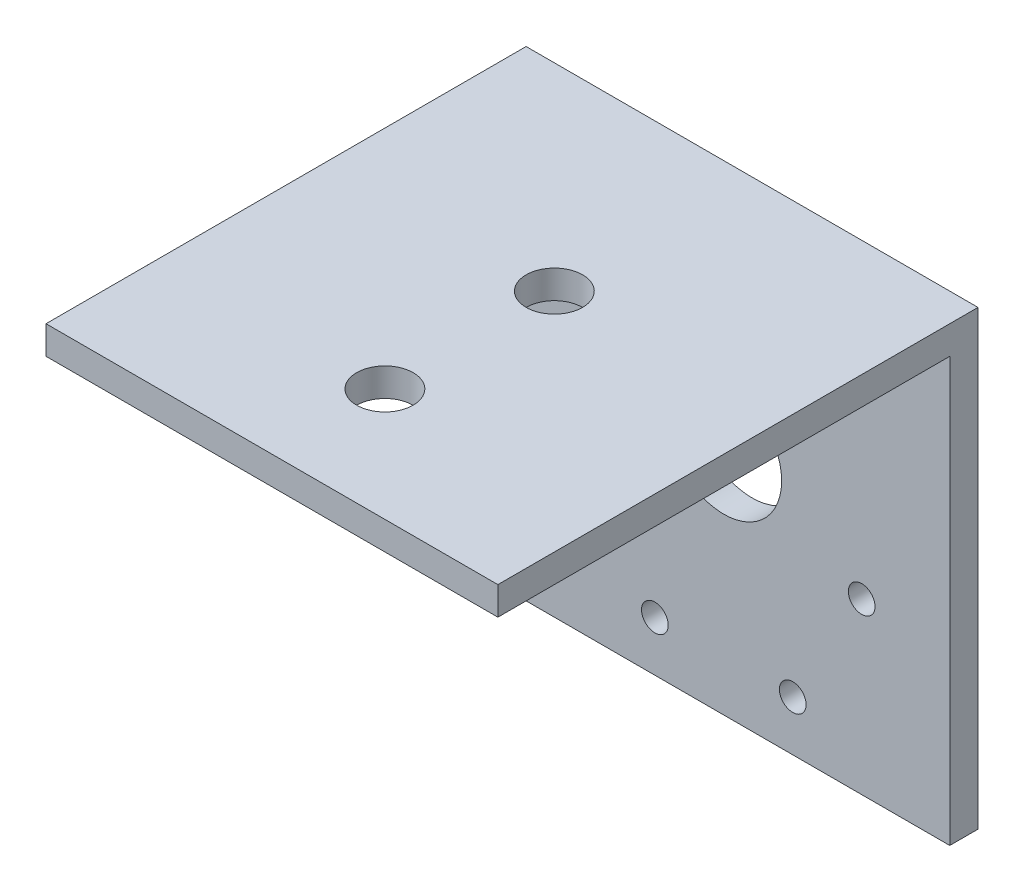
ISO-10303-21;
HEADER;
FILE_DESCRIPTION(('STEP AP214'),'2;1');
FILE_NAME('part.step','',(''),(''),'','','');
FILE_SCHEMA(('AUTOMOTIVE_DESIGN { 1 0 10303 214 1 1 1 1 }'));
ENDSEC;
DATA;
#1=APPLICATION_CONTEXT('core data for automotive mechanical design processes');
#2=APPLICATION_PROTOCOL_DEFINITION('international standard','automotive_design',2000,#1);
#3=PRODUCT_CONTEXT('',#1,'mechanical');
#4=PRODUCT('Part','Part','',(#3));
#5=PRODUCT_RELATED_PRODUCT_CATEGORY('part','',(#4));
#6=PRODUCT_DEFINITION_FORMATION('','',#4);
#7=PRODUCT_DEFINITION_CONTEXT('part definition',#1,'design');
#8=PRODUCT_DEFINITION('design','',#6,#7);
#9=PRODUCT_DEFINITION_SHAPE('','',#8);
#10=(LENGTH_UNIT() NAMED_UNIT(*) SI_UNIT(.MILLI.,.METRE.));
#11=(NAMED_UNIT(*) PLANE_ANGLE_UNIT() SI_UNIT($,.RADIAN.));
#12=(NAMED_UNIT(*) SI_UNIT($,.STERADIAN.) SOLID_ANGLE_UNIT());
#13=UNCERTAINTY_MEASURE_WITH_UNIT(LENGTH_MEASURE(1.E-05),#10,'distance_accuracy_value','');
#14=(GEOMETRIC_REPRESENTATION_CONTEXT(3) GLOBAL_UNCERTAINTY_ASSIGNED_CONTEXT((#13)) GLOBAL_UNIT_ASSIGNED_CONTEXT((#10,
#11,#12)) REPRESENTATION_CONTEXT('',''));
#15=CARTESIAN_POINT('',(0.,0.,0.));
#16=DIRECTION('',(0.,0.,1.));
#17=DIRECTION('',(1.,0.,0.));
#18=AXIS2_PLACEMENT_3D('',#15,#16,#17);
#19=CARTESIAN_POINT('',(0.,0.,3.175));
#20=DIRECTION('',(0.,0.,-1.));
#21=DIRECTION('',(-1.,0.,0.));
#22=AXIS2_PLACEMENT_3D('',#19,#20,#21);
#23=PLANE('',#22);
#24=CARTESIAN_POINT('',(33.15,32.4733937586588,3.175));
#25=DIRECTION('',(0.,0.,1.));
#26=DIRECTION('',(1.,0.,0.));
#27=AXIS2_PLACEMENT_3D('',#24,#25,#26);
#28=CIRCLE('',#27,1.50000000000002);
#29=CARTESIAN_POINT('',(34.65,32.4733937586588,3.175));
#30=VERTEX_POINT('',#29);
#31=EDGE_CURVE('E150',#30,#30,#28,.T.);
#32=ORIENTED_EDGE('',*,*,#31,.F.);
#33=EDGE_LOOP('',(#32));
#34=FACE_BOUND('',#33,.T.);
#35=CARTESIAN_POINT('',(17.65,5.62660624134121,3.175));
#36=DIRECTION('',(0.,0.,1.));
#37=DIRECTION('',(1.,0.,0.));
#38=AXIS2_PLACEMENT_3D('',#35,#36,#37);
#39=CIRCLE('',#38,1.50000000000001);
#40=CARTESIAN_POINT('',(19.15,5.62660624134121,3.175));
#41=VERTEX_POINT('',#40);
#42=EDGE_CURVE('E162',#41,#41,#39,.T.);
#43=ORIENTED_EDGE('',*,*,#42,.F.);
#44=EDGE_LOOP('',(#43));
#45=FACE_BOUND('',#44,.T.);
#46=CARTESIAN_POINT('',(40.9,19.05,3.175));
#47=DIRECTION('',(0.,0.,1.));
#48=DIRECTION('',(1.,0.,0.));
#49=AXIS2_PLACEMENT_3D('',#46,#47,#48);
#50=CIRCLE('',#49,1.5);
#51=CARTESIAN_POINT('',(42.4,19.05,3.175));
#52=VERTEX_POINT('',#51);
#53=EDGE_CURVE('E174',#52,#52,#50,.T.);
#54=ORIENTED_EDGE('',*,*,#53,.F.);
#55=EDGE_LOOP('',(#54));
#56=FACE_BOUND('',#55,.T.);
#57=CARTESIAN_POINT('',(25.4,26.05,3.175));
#58=DIRECTION('',(0.,0.,1.));
#59=DIRECTION('',(1.,0.,0.));
#60=AXIS2_PLACEMENT_3D('',#57,#58,#59);
#61=CIRCLE('',#60,6.50000000000002);
#62=CARTESIAN_POINT('',(31.9,26.05,3.175));
#63=VERTEX_POINT('',#62);
#64=EDGE_CURVE('E103',#63,#63,#61,.T.);
#65=ORIENTED_EDGE('',*,*,#64,.F.);
#66=EDGE_LOOP('',(#65));
#67=FACE_BOUND('',#66,.T.);
#68=CARTESIAN_POINT('',(9.90000000000003,19.05,3.175));
#69=DIRECTION('',(0.,0.,1.));
#70=DIRECTION('',(1.,0.,0.));
#71=AXIS2_PLACEMENT_3D('',#68,#69,#70);
#72=CIRCLE('',#71,1.5);
#73=CARTESIAN_POINT('',(11.4,19.05,3.175));
#74=VERTEX_POINT('',#73);
#75=EDGE_CURVE('E180',#74,#74,#72,.T.);
#76=ORIENTED_EDGE('',*,*,#75,.F.);
#77=EDGE_LOOP('',(#76));
#78=FACE_BOUND('',#77,.T.);
#79=CARTESIAN_POINT('',(33.15,5.62660624134121,3.175));
#80=DIRECTION('',(0.,0.,1.));
#81=DIRECTION('',(1.,0.,0.));
#82=AXIS2_PLACEMENT_3D('',#79,#80,#81);
#83=CIRCLE('',#82,1.5);
#84=CARTESIAN_POINT('',(34.65,5.62660624134121,3.175));
#85=VERTEX_POINT('',#84);
#86=EDGE_CURVE('E168',#85,#85,#83,.T.);
#87=ORIENTED_EDGE('',*,*,#86,.F.);
#88=EDGE_LOOP('',(#87));
#89=FACE_BOUND('',#88,.T.);
#90=CARTESIAN_POINT('',(17.65,32.4733937586588,3.175));
#91=DIRECTION('',(0.,0.,1.));
#92=DIRECTION('',(1.,0.,0.));
#93=AXIS2_PLACEMENT_3D('',#90,#91,#92);
#94=CIRCLE('',#93,1.50000000000001);
#95=CARTESIAN_POINT('',(19.15,32.4733937586588,3.175));
#96=VERTEX_POINT('',#95);
#97=EDGE_CURVE('E156',#96,#96,#94,.T.);
#98=ORIENTED_EDGE('',*,*,#97,.F.);
#99=EDGE_LOOP('',(#98));
#100=FACE_BOUND('',#99,.T.);
#101=DIRECTION('',(1.,0.,0.));
#102=VECTOR('',#101,1.);
#103=CARTESIAN_POINT('',(0.,47.625,3.175));
#104=LINE('',#103,#102);
#105=CARTESIAN_POINT('',(0.,47.625,3.175));
#106=VERTEX_POINT('',#105);
#107=CARTESIAN_POINT('',(50.8,47.625,3.175));
#108=VERTEX_POINT('',#107);
#109=EDGE_CURVE('E50',#106,#108,#104,.T.);
#110=ORIENTED_EDGE('',*,*,#109,.F.);
#111=DIRECTION('',(0.,-1.,0.));
#112=VECTOR('',#111,1.);
#113=CARTESIAN_POINT('',(0.,0.,3.175));
#114=LINE('',#113,#112);
#115=CARTESIAN_POINT('',(0.,0.,3.175));
#116=VERTEX_POINT('',#115);
#117=EDGE_CURVE('E87',#106,#116,#114,.T.);
#118=ORIENTED_EDGE('',*,*,#117,.T.);
#119=DIRECTION('',(1.,0.,0.));
#120=VECTOR('',#119,1.);
#121=CARTESIAN_POINT('',(0.,0.,3.175));
#122=LINE('',#121,#120);
#123=CARTESIAN_POINT('',(50.8,0.,3.175));
#124=VERTEX_POINT('',#123);
#125=EDGE_CURVE('E56',#116,#124,#122,.T.);
#126=ORIENTED_EDGE('',*,*,#125,.T.);
#127=DIRECTION('',(0.,1.,0.));
#128=VECTOR('',#127,1.);
#129=CARTESIAN_POINT('',(50.8,0.,3.175));
#130=LINE('',#129,#128);
#131=EDGE_CURVE('E98',#124,#108,#130,.T.);
#132=ORIENTED_EDGE('',*,*,#131,.T.);
#133=EDGE_LOOP('',(#110,#118,#126,#132));
#134=FACE_BOUND('',#133,.T.);
#135=ADVANCED_FACE('F33',(#34,#45,#56,#67,#78,#89,#100,#134),#23,.F.);
#136=CARTESIAN_POINT('',(0.,0.,0.));
#137=DIRECTION('',(0.,0.,-1.));
#138=DIRECTION('',(-1.,0.,0.));
#139=AXIS2_PLACEMENT_3D('',#136,#137,#138);
#140=PLANE('',#139);
#141=CARTESIAN_POINT('',(17.65,32.4733937586588,0.));
#142=DIRECTION('',(0.,0.,1.));
#143=DIRECTION('',(1.,0.,0.));
#144=AXIS2_PLACEMENT_3D('',#141,#142,#143);
#145=CIRCLE('',#144,1.50000000000001);
#146=CARTESIAN_POINT('',(19.15,32.4733937586588,0.));
#147=VERTEX_POINT('',#146);
#148=EDGE_CURVE('E153',#147,#147,#145,.T.);
#149=ORIENTED_EDGE('',*,*,#148,.T.);
#150=EDGE_LOOP('',(#149));
#151=FACE_BOUND('',#150,.T.);
#152=CARTESIAN_POINT('',(33.15,5.62660624134121,0.));
#153=DIRECTION('',(0.,0.,1.));
#154=DIRECTION('',(1.,0.,0.));
#155=AXIS2_PLACEMENT_3D('',#152,#153,#154);
#156=CIRCLE('',#155,1.5);
#157=CARTESIAN_POINT('',(34.65,5.62660624134121,0.));
#158=VERTEX_POINT('',#157);
#159=EDGE_CURVE('E165',#158,#158,#156,.T.);
#160=ORIENTED_EDGE('',*,*,#159,.T.);
#161=EDGE_LOOP('',(#160));
#162=FACE_BOUND('',#161,.T.);
#163=CARTESIAN_POINT('',(9.90000000000003,19.05,0.));
#164=DIRECTION('',(0.,0.,1.));
#165=DIRECTION('',(1.,0.,0.));
#166=AXIS2_PLACEMENT_3D('',#163,#164,#165);
#167=CIRCLE('',#166,1.5);
#168=CARTESIAN_POINT('',(11.4,19.05,0.));
#169=VERTEX_POINT('',#168);
#170=EDGE_CURVE('E177',#169,#169,#167,.T.);
#171=ORIENTED_EDGE('',*,*,#170,.T.);
#172=EDGE_LOOP('',(#171));
#173=FACE_BOUND('',#172,.T.);
#174=DIRECTION('',(0.,-1.,0.));
#175=VECTOR('',#174,1.);
#176=CARTESIAN_POINT('',(0.,0.,0.));
#177=LINE('',#176,#175);
#178=CARTESIAN_POINT('',(0.,50.8,0.));
#179=VERTEX_POINT('',#178);
#180=CARTESIAN_POINT('',(0.,0.,0.));
#181=VERTEX_POINT('',#180);
#182=EDGE_CURVE('E94',#179,#181,#177,.T.);
#183=ORIENTED_EDGE('',*,*,#182,.F.);
#184=DIRECTION('',(-1.,0.,0.));
#185=VECTOR('',#184,1.);
#186=CARTESIAN_POINT('',(0.,50.8,0.));
#187=LINE('',#186,#185);
#188=CARTESIAN_POINT('',(50.8,50.8,0.));
#189=VERTEX_POINT('',#188);
#190=EDGE_CURVE('E76',#189,#179,#187,.T.);
#191=ORIENTED_EDGE('',*,*,#190,.F.);
#192=DIRECTION('',(0.,1.,0.));
#193=VECTOR('',#192,1.);
#194=CARTESIAN_POINT('',(50.8,0.,0.));
#195=LINE('',#194,#193);
#196=CARTESIAN_POINT('',(50.8,0.,0.));
#197=VERTEX_POINT('',#196);
#198=EDGE_CURVE('E88',#197,#189,#195,.T.);
#199=ORIENTED_EDGE('',*,*,#198,.F.);
#200=DIRECTION('',(1.,0.,0.));
#201=VECTOR('',#200,1.);
#202=CARTESIAN_POINT('',(0.,0.,0.));
#203=LINE('',#202,#201);
#204=EDGE_CURVE('E102',#181,#197,#203,.T.);
#205=ORIENTED_EDGE('',*,*,#204,.F.);
#206=EDGE_LOOP('',(#183,#191,#199,#205));
#207=FACE_BOUND('',#206,.T.);
#208=CARTESIAN_POINT('',(25.4,26.05,0.));
#209=DIRECTION('',(0.,0.,1.));
#210=DIRECTION('',(1.,0.,0.));
#211=AXIS2_PLACEMENT_3D('',#208,#209,#210);
#212=CIRCLE('',#211,6.50000000000002);
#213=CARTESIAN_POINT('',(31.9,26.05,0.));
#214=VERTEX_POINT('',#213);
#215=EDGE_CURVE('E107',#214,#214,#212,.T.);
#216=ORIENTED_EDGE('',*,*,#215,.T.);
#217=EDGE_LOOP('',(#216));
#218=FACE_BOUND('',#217,.T.);
#219=CARTESIAN_POINT('',(40.9,19.05,0.));
#220=DIRECTION('',(0.,0.,1.));
#221=DIRECTION('',(1.,0.,0.));
#222=AXIS2_PLACEMENT_3D('',#219,#220,#221);
#223=CIRCLE('',#222,1.5);
#224=CARTESIAN_POINT('',(42.4,19.05,0.));
#225=VERTEX_POINT('',#224);
#226=EDGE_CURVE('E171',#225,#225,#223,.T.);
#227=ORIENTED_EDGE('',*,*,#226,.T.);
#228=EDGE_LOOP('',(#227));
#229=FACE_BOUND('',#228,.T.);
#230=CARTESIAN_POINT('',(17.65,5.62660624134121,0.));
#231=DIRECTION('',(0.,0.,1.));
#232=DIRECTION('',(1.,0.,0.));
#233=AXIS2_PLACEMENT_3D('',#230,#231,#232);
#234=CIRCLE('',#233,1.50000000000001);
#235=CARTESIAN_POINT('',(19.15,5.62660624134121,0.));
#236=VERTEX_POINT('',#235);
#237=EDGE_CURVE('E159',#236,#236,#234,.T.);
#238=ORIENTED_EDGE('',*,*,#237,.T.);
#239=EDGE_LOOP('',(#238));
#240=FACE_BOUND('',#239,.T.);
#241=CARTESIAN_POINT('',(33.15,32.4733937586588,0.));
#242=DIRECTION('',(0.,0.,1.));
#243=DIRECTION('',(1.,0.,0.));
#244=AXIS2_PLACEMENT_3D('',#241,#242,#243);
#245=CIRCLE('',#244,1.50000000000002);
#246=CARTESIAN_POINT('',(34.65,32.4733937586588,0.));
#247=VERTEX_POINT('',#246);
#248=EDGE_CURVE('E142',#247,#247,#245,.T.);
#249=ORIENTED_EDGE('',*,*,#248,.T.);
#250=EDGE_LOOP('',(#249));
#251=FACE_BOUND('',#250,.T.);
#252=ADVANCED_FACE('F100',(#151,#162,#173,#207,#218,#229,#240,#251),#140,.T.);
#253=CARTESIAN_POINT('',(0.,0.,3.175));
#254=DIRECTION('',(1.,0.,0.));
#255=DIRECTION('',(0.,0.,-1.));
#256=AXIS2_PLACEMENT_3D('',#253,#254,#255);
#257=PLANE('',#256);
#258=ORIENTED_EDGE('',*,*,#182,.T.);
#259=DIRECTION('',(0.,0.,-1.));
#260=VECTOR('',#259,1.);
#261=CARTESIAN_POINT('',(0.,0.,3.175));
#262=LINE('',#261,#260);
#263=EDGE_CURVE('E11',#116,#181,#262,.T.);
#264=ORIENTED_EDGE('',*,*,#263,.F.);
#265=ORIENTED_EDGE('',*,*,#117,.F.);
#266=DIRECTION('',(0.,0.,-1.));
#267=VECTOR('',#266,1.);
#268=CARTESIAN_POINT('',(0.,47.625,53.975));
#269=LINE('',#268,#267);
#270=CARTESIAN_POINT('',(0.,47.625,53.975));
#271=VERTEX_POINT('',#270);
#272=EDGE_CURVE('E135',#271,#106,#269,.T.);
#273=ORIENTED_EDGE('',*,*,#272,.F.);
#274=DIRECTION('',(0.,-1.,0.));
#275=VECTOR('',#274,1.);
#276=CARTESIAN_POINT('',(0.,50.8,53.975));
#277=LINE('',#276,#275);
#278=CARTESIAN_POINT('',(0.,50.8,53.975));
#279=VERTEX_POINT('',#278);
#280=EDGE_CURVE('E97',#279,#271,#277,.T.);
#281=ORIENTED_EDGE('',*,*,#280,.F.);
#282=DIRECTION('',(0.,0.,-1.));
#283=VECTOR('',#282,1.);
#284=CARTESIAN_POINT('',(0.,50.8,3.175));
#285=LINE('',#284,#283);
#286=EDGE_CURVE('E80',#279,#179,#285,.T.);
#287=ORIENTED_EDGE('',*,*,#286,.T.);
#288=EDGE_LOOP('',(#258,#264,#265,#273,#281,#287));
#289=FACE_BOUND('',#288,.T.);
#290=ADVANCED_FACE('F35',(#289),#257,.F.);
#291=CARTESIAN_POINT('',(0.,0.,3.175));
#292=DIRECTION('',(0.,1.,0.));
#293=DIRECTION('',(-1.,0.,0.));
#294=AXIS2_PLACEMENT_3D('',#291,#292,#293);
#295=PLANE('',#294);
#296=ORIENTED_EDGE('',*,*,#204,.T.);
#297=DIRECTION('',(0.,0.,-1.));
#298=VECTOR('',#297,1.);
#299=CARTESIAN_POINT('',(50.8,0.,3.175));
#300=LINE('',#299,#298);
#301=EDGE_CURVE('E42',#124,#197,#300,.T.);
#302=ORIENTED_EDGE('',*,*,#301,.F.);
#303=ORIENTED_EDGE('',*,*,#125,.F.);
#304=ORIENTED_EDGE('',*,*,#263,.T.);
#305=EDGE_LOOP('',(#296,#302,#303,#304));
#306=FACE_BOUND('',#305,.T.);
#307=ADVANCED_FACE('F217',(#306),#295,.F.);
#308=CARTESIAN_POINT('',(50.8,0.,3.175));
#309=DIRECTION('',(-1.,0.,0.));
#310=DIRECTION('',(0.,-1.,0.));
#311=AXIS2_PLACEMENT_3D('',#308,#309,#310);
#312=PLANE('',#311);
#313=ORIENTED_EDGE('',*,*,#198,.T.);
#314=DIRECTION('',(0.,0.,-1.));
#315=VECTOR('',#314,1.);
#316=CARTESIAN_POINT('',(50.8,50.8,3.175));
#317=LINE('',#316,#315);
#318=CARTESIAN_POINT('',(50.8,50.8,53.975));
#319=VERTEX_POINT('',#318);
#320=EDGE_CURVE('E83',#319,#189,#317,.T.);
#321=ORIENTED_EDGE('',*,*,#320,.F.);
#322=DIRECTION('',(0.,1.,0.));
#323=VECTOR('',#322,1.);
#324=CARTESIAN_POINT('',(50.8,50.8,53.975));
#325=LINE('',#324,#323);
#326=CARTESIAN_POINT('',(50.8,47.625,53.975));
#327=VERTEX_POINT('',#326);
#328=EDGE_CURVE('E139',#327,#319,#325,.T.);
#329=ORIENTED_EDGE('',*,*,#328,.F.);
#330=DIRECTION('',(0.,0.,-1.));
#331=VECTOR('',#330,1.);
#332=CARTESIAN_POINT('',(50.8,47.625,53.975));
#333=LINE('',#332,#331);
#334=EDGE_CURVE('E133',#327,#108,#333,.T.);
#335=ORIENTED_EDGE('',*,*,#334,.T.);
#336=ORIENTED_EDGE('',*,*,#131,.F.);
#337=ORIENTED_EDGE('',*,*,#301,.T.);
#338=EDGE_LOOP('',(#313,#321,#329,#335,#336,#337));
#339=FACE_BOUND('',#338,.T.);
#340=ADVANCED_FACE('F137',(#339),#312,.F.);
#341=CARTESIAN_POINT('',(0.,50.8,3.175));
#342=DIRECTION('',(0.,-1.,0.));
#343=DIRECTION('',(1.,0.,0.));
#344=AXIS2_PLACEMENT_3D('',#341,#342,#343);
#345=PLANE('',#344);
#346=CARTESIAN_POINT('',(25.4,50.8,22.225));
#347=DIRECTION('',(0.,-1.,0.));
#348=DIRECTION('',(0.,0.,-1.));
#349=AXIS2_PLACEMENT_3D('',#346,#347,#348);
#350=CIRCLE('',#349,3.175);
#351=CARTESIAN_POINT('',(25.4,50.8,19.05));
#352=VERTEX_POINT('',#351);
#353=EDGE_CURVE('E235',#352,#352,#350,.T.);
#354=ORIENTED_EDGE('',*,*,#353,.T.);
#355=EDGE_LOOP('',(#354));
#356=FACE_BOUND('',#355,.T.);
#357=CARTESIAN_POINT('',(25.4,50.8,41.275));
#358=DIRECTION('',(0.,-1.,0.));
#359=DIRECTION('',(0.,0.,-1.));
#360=AXIS2_PLACEMENT_3D('',#357,#358,#359);
#361=CIRCLE('',#360,3.175);
#362=CARTESIAN_POINT('',(25.4,50.8,38.1));
#363=VERTEX_POINT('',#362);
#364=EDGE_CURVE('E136',#363,#363,#361,.T.);
#365=ORIENTED_EDGE('',*,*,#364,.T.);
#366=EDGE_LOOP('',(#365));
#367=FACE_BOUND('',#366,.T.);
#368=ORIENTED_EDGE('',*,*,#190,.T.);
#369=ORIENTED_EDGE('',*,*,#286,.F.);
#370=DIRECTION('',(-1.,0.,0.));
#371=VECTOR('',#370,1.);
#372=CARTESIAN_POINT('',(0.,50.8,53.975));
#373=LINE('',#372,#371);
#374=EDGE_CURVE('E140',#319,#279,#373,.T.);
#375=ORIENTED_EDGE('',*,*,#374,.F.);
#376=ORIENTED_EDGE('',*,*,#320,.T.);
#377=EDGE_LOOP('',(#368,#369,#375,#376));
#378=FACE_BOUND('',#377,.T.);
#379=ADVANCED_FACE('F78',(#356,#367,#378),#345,.F.);
#380=CARTESIAN_POINT('',(25.4,26.05,3.175));
#381=DIRECTION('',(0.,0.,-1.));
#382=DIRECTION('',(-1.,0.,0.));
#383=AXIS2_PLACEMENT_3D('',#380,#381,#382);
#384=CYLINDRICAL_SURFACE('',#383,6.50000000000002);
#385=ORIENTED_EDGE('',*,*,#64,.T.);
#386=EDGE_LOOP('',(#385));
#387=FACE_BOUND('',#386,.T.);
#388=ORIENTED_EDGE('',*,*,#215,.F.);
#389=EDGE_LOOP('',(#388));
#390=FACE_BOUND('',#389,.T.);
#391=ADVANCED_FACE('F190',(#387,#390),#384,.F.);
#392=CARTESIAN_POINT('',(9.90000000000003,19.05,3.175));
#393=DIRECTION('',(0.,0.,-1.));
#394=DIRECTION('',(-1.,0.,0.));
#395=AXIS2_PLACEMENT_3D('',#392,#393,#394);
#396=CYLINDRICAL_SURFACE('',#395,1.5);
#397=ORIENTED_EDGE('',*,*,#75,.T.);
#398=EDGE_LOOP('',(#397));
#399=FACE_BOUND('',#398,.T.);
#400=ORIENTED_EDGE('',*,*,#170,.F.);
#401=EDGE_LOOP('',(#400));
#402=FACE_BOUND('',#401,.T.);
#403=ADVANCED_FACE('F187',(#399,#402),#396,.F.);
#404=CARTESIAN_POINT('',(40.9,19.05,3.175));
#405=DIRECTION('',(0.,0.,-1.));
#406=DIRECTION('',(-1.,0.,0.));
#407=AXIS2_PLACEMENT_3D('',#404,#405,#406);
#408=CYLINDRICAL_SURFACE('',#407,1.5);
#409=ORIENTED_EDGE('',*,*,#53,.T.);
#410=EDGE_LOOP('',(#409));
#411=FACE_BOUND('',#410,.T.);
#412=ORIENTED_EDGE('',*,*,#226,.F.);
#413=EDGE_LOOP('',(#412));
#414=FACE_BOUND('',#413,.T.);
#415=ADVANCED_FACE('F189',(#411,#414),#408,.F.);
#416=CARTESIAN_POINT('',(33.15,5.62660624134121,3.175));
#417=DIRECTION('',(0.,0.,-1.));
#418=DIRECTION('',(-1.,0.,0.));
#419=AXIS2_PLACEMENT_3D('',#416,#417,#418);
#420=CYLINDRICAL_SURFACE('',#419,1.5);
#421=ORIENTED_EDGE('',*,*,#86,.T.);
#422=EDGE_LOOP('',(#421));
#423=FACE_BOUND('',#422,.T.);
#424=ORIENTED_EDGE('',*,*,#159,.F.);
#425=EDGE_LOOP('',(#424));
#426=FACE_BOUND('',#425,.T.);
#427=ADVANCED_FACE('F197',(#423,#426),#420,.F.);
#428=CARTESIAN_POINT('',(17.65,5.62660624134121,3.175));
#429=DIRECTION('',(0.,0.,-1.));
#430=DIRECTION('',(-1.,0.,0.));
#431=AXIS2_PLACEMENT_3D('',#428,#429,#430);
#432=CYLINDRICAL_SURFACE('',#431,1.50000000000001);
#433=ORIENTED_EDGE('',*,*,#42,.T.);
#434=EDGE_LOOP('',(#433));
#435=FACE_BOUND('',#434,.T.);
#436=ORIENTED_EDGE('',*,*,#237,.F.);
#437=EDGE_LOOP('',(#436));
#438=FACE_BOUND('',#437,.T.);
#439=ADVANCED_FACE('F273',(#435,#438),#432,.F.);
#440=CARTESIAN_POINT('',(17.65,32.4733937586588,3.175));
#441=DIRECTION('',(0.,0.,-1.));
#442=DIRECTION('',(-1.,0.,0.));
#443=AXIS2_PLACEMENT_3D('',#440,#441,#442);
#444=CYLINDRICAL_SURFACE('',#443,1.50000000000001);
#445=ORIENTED_EDGE('',*,*,#97,.T.);
#446=EDGE_LOOP('',(#445));
#447=FACE_BOUND('',#446,.T.);
#448=ORIENTED_EDGE('',*,*,#148,.F.);
#449=EDGE_LOOP('',(#448));
#450=FACE_BOUND('',#449,.T.);
#451=ADVANCED_FACE('F269',(#447,#450),#444,.F.);
#452=CARTESIAN_POINT('',(33.15,32.4733937586588,3.175));
#453=DIRECTION('',(0.,0.,-1.));
#454=DIRECTION('',(-1.,0.,0.));
#455=AXIS2_PLACEMENT_3D('',#452,#453,#454);
#456=CYLINDRICAL_SURFACE('',#455,1.50000000000002);
#457=ORIENTED_EDGE('',*,*,#31,.T.);
#458=EDGE_LOOP('',(#457));
#459=FACE_BOUND('',#458,.T.);
#460=ORIENTED_EDGE('',*,*,#248,.F.);
#461=EDGE_LOOP('',(#460));
#462=FACE_BOUND('',#461,.T.);
#463=ADVANCED_FACE('F254',(#459,#462),#456,.F.);
#464=CARTESIAN_POINT('',(0.,47.625,53.975));
#465=DIRECTION('',(0.,1.,0.));
#466=DIRECTION('',(0.,0.,1.));
#467=AXIS2_PLACEMENT_3D('',#464,#465,#466);
#468=PLANE('',#467);
#469=CARTESIAN_POINT('',(25.4,47.625,22.225));
#470=DIRECTION('',(0.,-1.,0.));
#471=DIRECTION('',(0.,0.,-1.));
#472=AXIS2_PLACEMENT_3D('',#469,#470,#471);
#473=CIRCLE('',#472,3.175);
#474=CARTESIAN_POINT('',(25.4,47.625,19.05));
#475=VERTEX_POINT('',#474);
#476=EDGE_CURVE('E238',#475,#475,#473,.T.);
#477=ORIENTED_EDGE('',*,*,#476,.F.);
#478=EDGE_LOOP('',(#477));
#479=FACE_BOUND('',#478,.T.);
#480=CARTESIAN_POINT('',(25.4,47.625,41.275));
#481=DIRECTION('',(0.,-1.,0.));
#482=DIRECTION('',(0.,0.,-1.));
#483=AXIS2_PLACEMENT_3D('',#480,#481,#482);
#484=CIRCLE('',#483,3.175);
#485=CARTESIAN_POINT('',(25.4,47.625,38.1));
#486=VERTEX_POINT('',#485);
#487=EDGE_CURVE('E232',#486,#486,#484,.T.);
#488=ORIENTED_EDGE('',*,*,#487,.F.);
#489=EDGE_LOOP('',(#488));
#490=FACE_BOUND('',#489,.T.);
#491=ORIENTED_EDGE('',*,*,#109,.T.);
#492=ORIENTED_EDGE('',*,*,#334,.F.);
#493=DIRECTION('',(1.,0.,0.));
#494=VECTOR('',#493,1.);
#495=CARTESIAN_POINT('',(0.,47.625,53.975));
#496=LINE('',#495,#494);
#497=EDGE_CURVE('E228',#271,#327,#496,.T.);
#498=ORIENTED_EDGE('',*,*,#497,.F.);
#499=ORIENTED_EDGE('',*,*,#272,.T.);
#500=EDGE_LOOP('',(#491,#492,#498,#499));
#501=FACE_BOUND('',#500,.T.);
#502=ADVANCED_FACE('F130',(#479,#490,#501),#468,.F.);
#503=CARTESIAN_POINT('',(0.,0.,53.975));
#504=DIRECTION('',(0.,0.,1.));
#505=DIRECTION('',(1.,0.,0.));
#506=AXIS2_PLACEMENT_3D('',#503,#504,#505);
#507=PLANE('',#506);
#508=ORIENTED_EDGE('',*,*,#280,.T.);
#509=ORIENTED_EDGE('',*,*,#497,.T.);
#510=ORIENTED_EDGE('',*,*,#328,.T.);
#511=ORIENTED_EDGE('',*,*,#374,.T.);
#512=EDGE_LOOP('',(#508,#509,#510,#511));
#513=FACE_BOUND('',#512,.T.);
#514=ADVANCED_FACE('F227',(#513),#507,.T.);
#515=CARTESIAN_POINT('',(25.4,50.8,41.275));
#516=DIRECTION('',(0.,-1.,0.));
#517=DIRECTION('',(0.,0.,-1.));
#518=AXIS2_PLACEMENT_3D('',#515,#516,#517);
#519=CYLINDRICAL_SURFACE('',#518,3.175);
#520=ORIENTED_EDGE('',*,*,#364,.F.);
#521=EDGE_LOOP('',(#520));
#522=FACE_BOUND('',#521,.T.);
#523=ORIENTED_EDGE('',*,*,#487,.T.);
#524=EDGE_LOOP('',(#523));
#525=FACE_BOUND('',#524,.T.);
#526=ADVANCED_FACE('F248',(#522,#525),#519,.F.);
#527=CARTESIAN_POINT('',(25.4,50.8,22.225));
#528=DIRECTION('',(0.,-1.,0.));
#529=DIRECTION('',(0.,0.,-1.));
#530=AXIS2_PLACEMENT_3D('',#527,#528,#529);
#531=CYLINDRICAL_SURFACE('',#530,3.175);
#532=ORIENTED_EDGE('',*,*,#353,.F.);
#533=EDGE_LOOP('',(#532));
#534=FACE_BOUND('',#533,.T.);
#535=ORIENTED_EDGE('',*,*,#476,.T.);
#536=EDGE_LOOP('',(#535));
#537=FACE_BOUND('',#536,.T.);
#538=ADVANCED_FACE('F245',(#534,#537),#531,.F.);
#539=CLOSED_SHELL('',(#135,#252,#290,#307,#340,#379,#391,#403,#415,#427,#439,#451,#463,#502,
#514,#526,#538));
#540=MANIFOLD_SOLID_BREP('B2',#539);
#541=ADVANCED_BREP_SHAPE_REPRESENTATION('',(#18,#540),#14);
#542=SHAPE_DEFINITION_REPRESENTATION(#9,#541);
ENDSEC;
END-ISO-10303-21;
